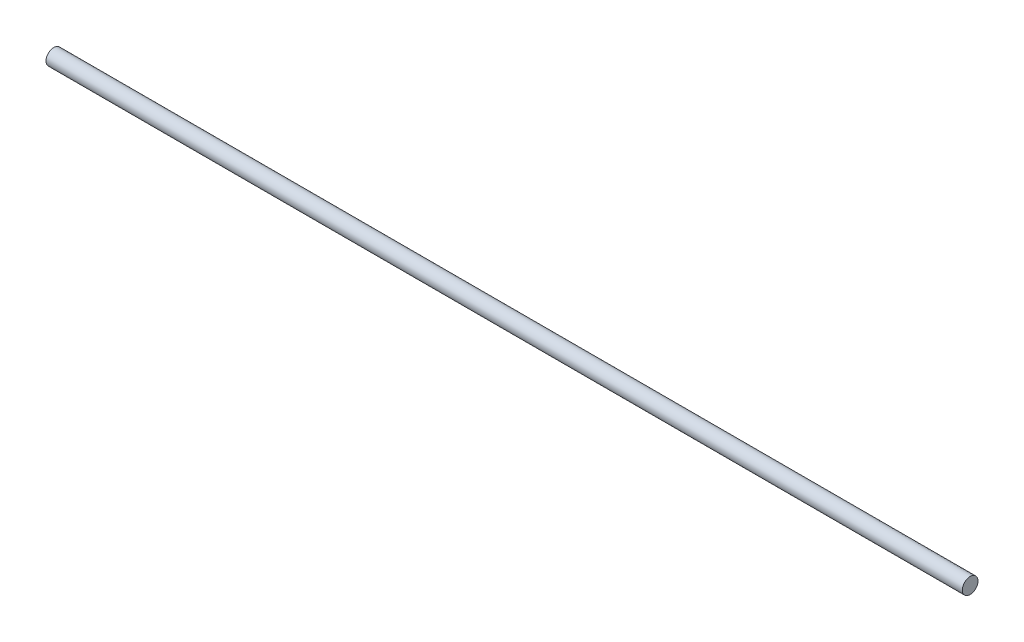
ISO-10303-21;
HEADER;
FILE_DESCRIPTION(('STEP AP214'),'2;1');
FILE_NAME('part.step','',(''),(''),'','','');
FILE_SCHEMA(('AUTOMOTIVE_DESIGN { 1 0 10303 214 1 1 1 1 }'));
ENDSEC;
DATA;
#1=APPLICATION_CONTEXT('core data for automotive mechanical design processes');
#2=APPLICATION_PROTOCOL_DEFINITION('international standard','automotive_design',2000,#1);
#3=PRODUCT_CONTEXT('',#1,'mechanical');
#4=PRODUCT('Part','Part','',(#3));
#5=PRODUCT_RELATED_PRODUCT_CATEGORY('part','',(#4));
#6=PRODUCT_DEFINITION_FORMATION('','',#4);
#7=PRODUCT_DEFINITION_CONTEXT('part definition',#1,'design');
#8=PRODUCT_DEFINITION('design','',#6,#7);
#9=PRODUCT_DEFINITION_SHAPE('','',#8);
#10=(LENGTH_UNIT() NAMED_UNIT(*) SI_UNIT(.MILLI.,.METRE.));
#11=(NAMED_UNIT(*) PLANE_ANGLE_UNIT() SI_UNIT($,.RADIAN.));
#12=(NAMED_UNIT(*) SI_UNIT($,.STERADIAN.) SOLID_ANGLE_UNIT());
#13=UNCERTAINTY_MEASURE_WITH_UNIT(LENGTH_MEASURE(1.E-05),#10,'distance_accuracy_value','');
#14=(GEOMETRIC_REPRESENTATION_CONTEXT(3) GLOBAL_UNCERTAINTY_ASSIGNED_CONTEXT((#13)) GLOBAL_UNIT_ASSIGNED_CONTEXT((#10,
#11,#12)) REPRESENTATION_CONTEXT('',''));
#15=CARTESIAN_POINT('',(0.,0.,0.));
#16=DIRECTION('',(0.,0.,1.));
#17=DIRECTION('',(1.,0.,0.));
#18=AXIS2_PLACEMENT_3D('',#15,#16,#17);
#19=CARTESIAN_POINT('',(292.,0.,0.));
#20=DIRECTION('',(-1.,0.,0.));
#21=DIRECTION('',(0.,0.,1.));
#22=AXIS2_PLACEMENT_3D('',#19,#20,#21);
#23=CYLINDRICAL_SURFACE('',#22,2.5);
#24=CARTESIAN_POINT('',(292.,0.,0.));
#25=DIRECTION('',(1.,0.,0.));
#26=DIRECTION('',(0.,0.,-1.));
#27=AXIS2_PLACEMENT_3D('',#24,#25,#26);
#28=CIRCLE('',#27,2.5);
#29=CARTESIAN_POINT('',(292.,0.,-2.5));
#30=VERTEX_POINT('',#29);
#31=EDGE_CURVE('E10',#30,#30,#28,.T.);
#32=ORIENTED_EDGE('',*,*,#31,.F.);
#33=EDGE_LOOP('',(#32));
#34=FACE_BOUND('',#33,.T.);
#35=CARTESIAN_POINT('',(0.,0.,0.));
#36=DIRECTION('',(1.,0.,0.));
#37=DIRECTION('',(0.,0.,-1.));
#38=AXIS2_PLACEMENT_3D('',#35,#36,#37);
#39=CIRCLE('',#38,2.5);
#40=CARTESIAN_POINT('',(0.,0.,-2.5));
#41=VERTEX_POINT('',#40);
#42=EDGE_CURVE('E36',#41,#41,#39,.T.);
#43=ORIENTED_EDGE('',*,*,#42,.T.);
#44=EDGE_LOOP('',(#43));
#45=FACE_BOUND('',#44,.T.);
#46=ADVANCED_FACE('F33',(#34,#45),#23,.T.);
#47=CARTESIAN_POINT('',(292.,0.,0.));
#48=DIRECTION('',(1.,0.,0.));
#49=DIRECTION('',(0.,0.,-1.));
#50=AXIS2_PLACEMENT_3D('',#47,#48,#49);
#51=PLANE('',#50);
#52=ORIENTED_EDGE('',*,*,#31,.T.);
#53=EDGE_LOOP('',(#52));
#54=FACE_BOUND('',#53,.T.);
#55=ADVANCED_FACE('F48',(#54),#51,.T.);
#56=CARTESIAN_POINT('',(0.,0.,0.));
#57=DIRECTION('',(1.,0.,0.));
#58=DIRECTION('',(0.,0.,-1.));
#59=AXIS2_PLACEMENT_3D('',#56,#57,#58);
#60=PLANE('',#59);
#61=ORIENTED_EDGE('',*,*,#42,.F.);
#62=EDGE_LOOP('',(#61));
#63=FACE_BOUND('',#62,.T.);
#64=ADVANCED_FACE('F46',(#63),#60,.F.);
#65=CLOSED_SHELL('',(#46,#55,#64));
#66=MANIFOLD_SOLID_BREP('B2',#65);
#67=ADVANCED_BREP_SHAPE_REPRESENTATION('',(#18,#66),#14);
#68=SHAPE_DEFINITION_REPRESENTATION(#9,#67);
ENDSEC;
END-ISO-10303-21;
